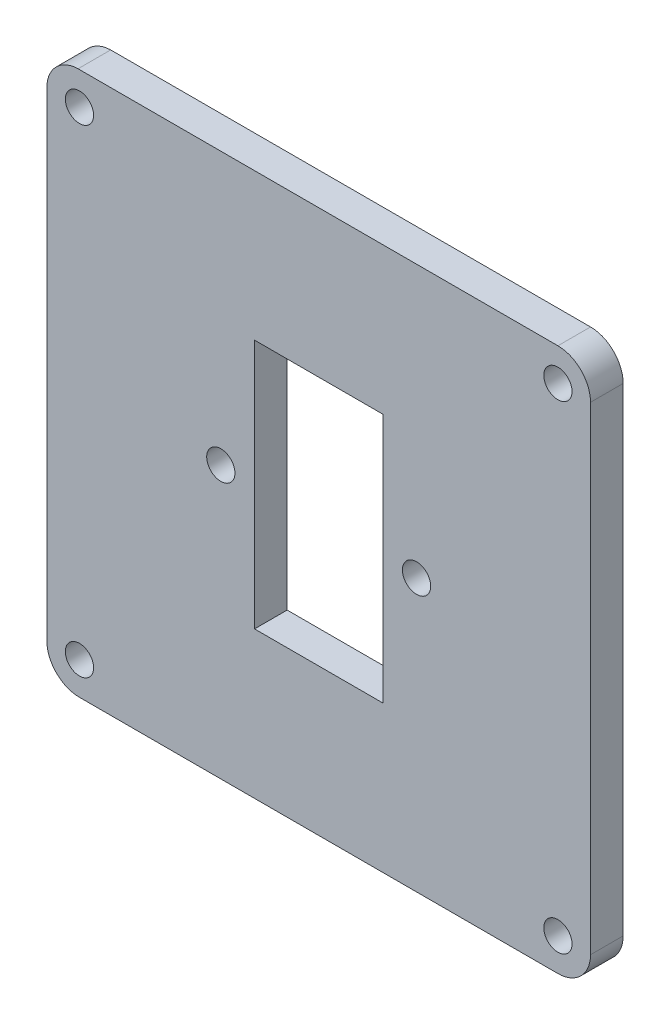
ISO-10303-21;
HEADER;
FILE_DESCRIPTION(('STEP AP214'),'2;1');
FILE_NAME('part.step','',(''),(''),'','','');
FILE_SCHEMA(('AUTOMOTIVE_DESIGN { 1 0 10303 214 1 1 1 1 }'));
ENDSEC;
DATA;
#1=APPLICATION_CONTEXT('core data for automotive mechanical design processes');
#2=APPLICATION_PROTOCOL_DEFINITION('international standard','automotive_design',2000,#1);
#3=PRODUCT_CONTEXT('',#1,'mechanical');
#4=PRODUCT('Part','Part','',(#3));
#5=PRODUCT_RELATED_PRODUCT_CATEGORY('part','',(#4));
#6=PRODUCT_DEFINITION_FORMATION('','',#4);
#7=PRODUCT_DEFINITION_CONTEXT('part definition',#1,'design');
#8=PRODUCT_DEFINITION('design','',#6,#7);
#9=PRODUCT_DEFINITION_SHAPE('','',#8);
#10=(LENGTH_UNIT() NAMED_UNIT(*) SI_UNIT(.MILLI.,.METRE.));
#11=(NAMED_UNIT(*) PLANE_ANGLE_UNIT() SI_UNIT($,.RADIAN.));
#12=(NAMED_UNIT(*) SI_UNIT($,.STERADIAN.) SOLID_ANGLE_UNIT());
#13=UNCERTAINTY_MEASURE_WITH_UNIT(LENGTH_MEASURE(1.E-05),#10,'distance_accuracy_value','');
#14=(GEOMETRIC_REPRESENTATION_CONTEXT(3) GLOBAL_UNCERTAINTY_ASSIGNED_CONTEXT((#13)) GLOBAL_UNIT_ASSIGNED_CONTEXT((#10,
#11,#12)) REPRESENTATION_CONTEXT('',''));
#15=CARTESIAN_POINT('',(0.,0.,0.));
#16=DIRECTION('',(0.,0.,1.));
#17=DIRECTION('',(1.,0.,0.));
#18=AXIS2_PLACEMENT_3D('',#15,#16,#17);
#19=CARTESIAN_POINT('',(36.3223987519712,20.1294987578669,3.));
#20=DIRECTION('',(0.,0.,1.));
#21=DIRECTION('',(1.,0.,0.));
#22=AXIS2_PLACEMENT_3D('',#19,#20,#21);
#23=PLANE('',#22);
#24=CARTESIAN_POINT('',(36.3225499958682,20.1296499967222,3.));
#25=DIRECTION('',(0.,0.,1.));
#26=DIRECTION('',(1.,0.,0.));
#27=AXIS2_PLACEMENT_3D('',#24,#25,#26);
#28=CIRCLE('',#27,1.29995000480762);
#29=CARTESIAN_POINT('',(37.6225000006758,20.1296499967222,3.));
#30=VERTEX_POINT('',#29);
#31=EDGE_CURVE('E164',#30,#30,#28,.T.);
#32=ORIENTED_EDGE('',*,*,#31,.F.);
#33=EDGE_LOOP('',(#32));
#34=FACE_BOUND('',#33,.T.);
#35=CARTESIAN_POINT('',(67.3225499958679,42.1296499967222,3.));
#36=DIRECTION('',(0.,0.,1.));
#37=DIRECTION('',(1.,0.,0.));
#38=AXIS2_PLACEMENT_3D('',#35,#36,#37);
#39=CIRCLE('',#38,1.29995000480762);
#40=CARTESIAN_POINT('',(68.6225000006755,42.1296499967222,3.));
#41=VERTEX_POINT('',#40);
#42=EDGE_CURVE('E176',#41,#41,#39,.T.);
#43=ORIENTED_EDGE('',*,*,#42,.F.);
#44=EDGE_LOOP('',(#43));
#45=FACE_BOUND('',#44,.T.);
#46=CARTESIAN_POINT('',(36.322500001637,64.1296999986452,3.));
#47=DIRECTION('',(0.,0.,1.));
#48=DIRECTION('',(1.,0.,0.));
#49=AXIS2_PLACEMENT_3D('',#46,#47,#48);
#50=CIRCLE('',#49,1.30000000192313);
#51=CARTESIAN_POINT('',(37.6225000035601,64.1296999986452,3.));
#52=VERTEX_POINT('',#51);
#53=EDGE_CURVE('E188',#52,#52,#50,.T.);
#54=ORIENTED_EDGE('',*,*,#53,.F.);
#55=EDGE_LOOP('',(#54));
#56=FACE_BOUND('',#55,.T.);
#57=CARTESIAN_POINT('',(36.3223987519712,20.1294987578669,3.));
#58=DIRECTION('',(0.,0.,1.));
#59=DIRECTION('',(1.,0.,0.));
#60=AXIS2_PLACEMENT_3D('',#57,#58,#59);
#61=CIRCLE('',#60,2.99989875900708);
#62=CARTESIAN_POINT('',(33.3224999997141,20.1297000005628,3.));
#63=VERTEX_POINT('',#62);
#64=CARTESIAN_POINT('',(36.3224999997142,17.1296000005684,3.));
#65=VERTEX_POINT('',#64);
#66=EDGE_CURVE('E194',#63,#65,#61,.T.);
#67=ORIENTED_EDGE('',*,*,#66,.T.);
#68=DIRECTION('',(1.,0.,0.));
#69=VECTOR('',#68,1.);
#70=CARTESIAN_POINT('',(80.3224999997142,17.1296000005683,3.));
#71=LINE('',#70,#69);
#72=CARTESIAN_POINT('',(80.3224999997142,17.1296000005683,3.));
#73=VERTEX_POINT('',#72);
#74=EDGE_CURVE('E197',#65,#73,#71,.T.);
#75=ORIENTED_EDGE('',*,*,#74,.T.);
#76=CARTESIAN_POINT('',(80.3224305409756,20.1296694586582,3.));
#77=DIRECTION('',(0.,0.,1.));
#78=DIRECTION('',(1.,0.,0.));
#79=AXIS2_PLACEMENT_3D('',#76,#77,#78);
#80=CIRCLE('',#79,3.00006945889396);
#81=CARTESIAN_POINT('',(83.3224999997141,20.1297000005485,3.));
#82=VERTEX_POINT('',#81);
#83=EDGE_CURVE('E200',#73,#82,#80,.T.);
#84=ORIENTED_EDGE('',*,*,#83,.T.);
#85=DIRECTION('',(0.,1.,0.));
#86=VECTOR('',#85,1.);
#87=CARTESIAN_POINT('',(83.3224999997141,64.1296000005696,3.));
#88=LINE('',#87,#86);
#89=CARTESIAN_POINT('',(83.3224999997141,64.1296000005696,3.));
#90=VERTEX_POINT('',#89);
#91=EDGE_CURVE('E202',#82,#90,#88,.T.);
#92=ORIENTED_EDGE('',*,*,#91,.T.);
#93=CARTESIAN_POINT('',(80.3225585752163,64.1296585760706,3.));
#94=DIRECTION('',(0.,0.,1.));
#95=DIRECTION('',(1.,0.,0.));
#96=AXIS2_PLACEMENT_3D('',#93,#94,#95);
#97=CIRCLE('',#96,2.99994142506962);
#98=CARTESIAN_POINT('',(80.322499999714,67.1296000005684,3.));
#99=VERTEX_POINT('',#98);
#100=EDGE_CURVE('E204',#90,#99,#97,.T.);
#101=ORIENTED_EDGE('',*,*,#100,.T.);
#102=DIRECTION('',(-0.999999997928593,-6.43646969992468E-05,0.));
#103=VECTOR('',#102,1.);
#104=CARTESIAN_POINT('',(36.1917165795784,67.1267595360593,3.));
#105=LINE('',#104,#103);
#106=CARTESIAN_POINT('',(36.1917165795784,67.1267595360593,3.));
#107=VERTEX_POINT('',#106);
#108=EDGE_CURVE('E206',#99,#107,#105,.T.);
#109=ORIENTED_EDGE('',*,*,#108,.T.);
#110=CARTESIAN_POINT('',(36.2554163805233,64.193831557889,3.));
#111=DIRECTION('',(0.,0.,1.));
#112=DIRECTION('',(1.,0.,0.));
#113=AXIS2_PLACEMENT_3D('',#110,#111,#112);
#114=CIRCLE('',#113,2.93361963958769);
#115=CARTESIAN_POINT('',(33.3224999997141,64.1296000005699,3.));
#116=VERTEX_POINT('',#115);
#117=EDGE_CURVE('E208',#107,#116,#114,.T.);
#118=ORIENTED_EDGE('',*,*,#117,.T.);
#119=DIRECTION('',(0.,-1.,0.));
#120=VECTOR('',#119,1.);
#121=CARTESIAN_POINT('',(33.3224999997141,20.1297000005628,3.));
#122=LINE('',#121,#120);
#123=EDGE_CURVE('E210',#116,#63,#122,.T.);
#124=ORIENTED_EDGE('',*,*,#123,.T.);
#125=EDGE_LOOP('',(#67,#75,#84,#92,#101,#109,#118,#124));
#126=FACE_BOUND('',#125,.T.);
#127=CARTESIAN_POINT('',(80.3225000016379,64.1296999986453,3.));
#128=DIRECTION('',(0.,0.,1.));
#129=DIRECTION('',(1.,0.,0.));
#130=AXIS2_PLACEMENT_3D('',#127,#128,#129);
#131=CIRCLE('',#130,1.30000000192322);
#132=CARTESIAN_POINT('',(81.6225000035611,64.1296999986453,3.));
#133=VERTEX_POINT('',#132);
#134=EDGE_CURVE('E182',#133,#133,#131,.T.);
#135=ORIENTED_EDGE('',*,*,#134,.F.);
#136=EDGE_LOOP('',(#135));
#137=FACE_BOUND('',#136,.T.);
#138=CARTESIAN_POINT('',(49.3224499997141,42.1296500005684,3.));
#139=DIRECTION('',(0.,0.,1.));
#140=DIRECTION('',(1.,0.,0.));
#141=AXIS2_PLACEMENT_3D('',#138,#139,#140);
#142=CIRCLE('',#141,1.2999500009616);
#143=CARTESIAN_POINT('',(50.6224000006757,42.1296500005684,3.));
#144=VERTEX_POINT('',#143);
#145=EDGE_CURVE('E170',#144,#144,#142,.T.);
#146=ORIENTED_EDGE('',*,*,#145,.F.);
#147=EDGE_LOOP('',(#146));
#148=FACE_BOUND('',#147,.T.);
#149=CARTESIAN_POINT('',(80.3225499958684,20.1296499967222,3.));
#150=DIRECTION('',(0.,0.,1.));
#151=DIRECTION('',(1.,0.,0.));
#152=AXIS2_PLACEMENT_3D('',#149,#150,#151);
#153=CIRCLE('',#152,1.29995000480758);
#154=CARTESIAN_POINT('',(81.622500000676,20.1296499967222,3.));
#155=VERTEX_POINT('',#154);
#156=EDGE_CURVE('E158',#155,#155,#153,.T.);
#157=ORIENTED_EDGE('',*,*,#156,.F.);
#158=EDGE_LOOP('',(#157));
#159=FACE_BOUND('',#158,.T.);
#160=DIRECTION('',(1.,0.,0.));
#161=VECTOR('',#160,1.);
#162=CARTESIAN_POINT('',(52.4224999997141,30.6296000005684,3.));
#163=LINE('',#162,#161);
#164=CARTESIAN_POINT('',(52.4224999997141,30.6296000005684,3.));
#165=VERTEX_POINT('',#164);
#166=CARTESIAN_POINT('',(64.2224999997142,30.6296000005684,3.));
#167=VERTEX_POINT('',#166);
#168=EDGE_CURVE('E130',#165,#167,#163,.T.);
#169=ORIENTED_EDGE('',*,*,#168,.F.);
#170=DIRECTION('',(0.,-1.,0.));
#171=VECTOR('',#170,1.);
#172=CARTESIAN_POINT('',(52.4224999997141,30.6296000005684,3.));
#173=LINE('',#172,#171);
#174=CARTESIAN_POINT('',(52.422499999714,53.6296000005683,3.));
#175=VERTEX_POINT('',#174);
#176=EDGE_CURVE('E122',#175,#165,#173,.T.);
#177=ORIENTED_EDGE('',*,*,#176,.F.);
#178=DIRECTION('',(-1.,0.,0.));
#179=VECTOR('',#178,1.);
#180=CARTESIAN_POINT('',(52.422499999714,53.6296000005683,3.));
#181=LINE('',#180,#179);
#182=CARTESIAN_POINT('',(64.222499999714,53.6296000005683,3.));
#183=VERTEX_POINT('',#182);
#184=EDGE_CURVE('E144',#183,#175,#181,.T.);
#185=ORIENTED_EDGE('',*,*,#184,.F.);
#186=DIRECTION('',(0.,1.,0.));
#187=VECTOR('',#186,1.);
#188=CARTESIAN_POINT('',(64.222499999714,53.6296000005683,3.));
#189=LINE('',#188,#187);
#190=EDGE_CURVE('E142',#167,#183,#189,.T.);
#191=ORIENTED_EDGE('',*,*,#190,.F.);
#192=EDGE_LOOP('',(#169,#177,#185,#191));
#193=FACE_BOUND('',#192,.T.);
#194=ADVANCED_FACE('F33',(#34,#45,#56,#126,#137,#148,#159,#193),#23,.T.);
#195=CARTESIAN_POINT('',(36.3223987519712,20.1294987578669,0.));
#196=DIRECTION('',(0.,0.,1.));
#197=DIRECTION('',(1.,0.,0.));
#198=AXIS2_PLACEMENT_3D('',#195,#196,#197);
#199=PLANE('',#198);
#200=CARTESIAN_POINT('',(80.3225499958684,20.1296499967222,0.));
#201=DIRECTION('',(0.,0.,1.));
#202=DIRECTION('',(1.,0.,0.));
#203=AXIS2_PLACEMENT_3D('',#200,#201,#202);
#204=CIRCLE('',#203,1.29995000480758);
#205=CARTESIAN_POINT('',(81.622500000676,20.1296499967222,0.));
#206=VERTEX_POINT('',#205);
#207=EDGE_CURVE('E138',#206,#206,#204,.T.);
#208=ORIENTED_EDGE('',*,*,#207,.T.);
#209=EDGE_LOOP('',(#208));
#210=FACE_BOUND('',#209,.T.);
#211=CARTESIAN_POINT('',(36.3225499958682,20.1296499967222,0.));
#212=DIRECTION('',(0.,0.,1.));
#213=DIRECTION('',(1.,0.,0.));
#214=AXIS2_PLACEMENT_3D('',#211,#212,#213);
#215=CIRCLE('',#214,1.29995000480762);
#216=CARTESIAN_POINT('',(37.6225000006758,20.1296499967222,0.));
#217=VERTEX_POINT('',#216);
#218=EDGE_CURVE('E161',#217,#217,#215,.T.);
#219=ORIENTED_EDGE('',*,*,#218,.T.);
#220=EDGE_LOOP('',(#219));
#221=FACE_BOUND('',#220,.T.);
#222=CARTESIAN_POINT('',(49.3224499997141,42.1296500005684,0.));
#223=DIRECTION('',(0.,0.,1.));
#224=DIRECTION('',(1.,0.,0.));
#225=AXIS2_PLACEMENT_3D('',#222,#223,#224);
#226=CIRCLE('',#225,1.2999500009616);
#227=CARTESIAN_POINT('',(50.6224000006757,42.1296500005684,0.));
#228=VERTEX_POINT('',#227);
#229=EDGE_CURVE('E167',#228,#228,#226,.T.);
#230=ORIENTED_EDGE('',*,*,#229,.T.);
#231=EDGE_LOOP('',(#230));
#232=FACE_BOUND('',#231,.T.);
#233=CARTESIAN_POINT('',(67.3225499958679,42.1296499967222,0.));
#234=DIRECTION('',(0.,0.,1.));
#235=DIRECTION('',(1.,0.,0.));
#236=AXIS2_PLACEMENT_3D('',#233,#234,#235);
#237=CIRCLE('',#236,1.29995000480762);
#238=CARTESIAN_POINT('',(68.6225000006755,42.1296499967222,0.));
#239=VERTEX_POINT('',#238);
#240=EDGE_CURVE('E173',#239,#239,#237,.T.);
#241=ORIENTED_EDGE('',*,*,#240,.T.);
#242=EDGE_LOOP('',(#241));
#243=FACE_BOUND('',#242,.T.);
#244=CARTESIAN_POINT('',(80.3225000016379,64.1296999986453,0.));
#245=DIRECTION('',(0.,0.,1.));
#246=DIRECTION('',(1.,0.,0.));
#247=AXIS2_PLACEMENT_3D('',#244,#245,#246);
#248=CIRCLE('',#247,1.30000000192322);
#249=CARTESIAN_POINT('',(81.6225000035611,64.1296999986453,0.));
#250=VERTEX_POINT('',#249);
#251=EDGE_CURVE('E179',#250,#250,#248,.T.);
#252=ORIENTED_EDGE('',*,*,#251,.T.);
#253=EDGE_LOOP('',(#252));
#254=FACE_BOUND('',#253,.T.);
#255=CARTESIAN_POINT('',(36.322500001637,64.1296999986452,0.));
#256=DIRECTION('',(0.,0.,1.));
#257=DIRECTION('',(1.,0.,0.));
#258=AXIS2_PLACEMENT_3D('',#255,#256,#257);
#259=CIRCLE('',#258,1.30000000192313);
#260=CARTESIAN_POINT('',(37.6225000035601,64.1296999986452,0.));
#261=VERTEX_POINT('',#260);
#262=EDGE_CURVE('E185',#261,#261,#259,.T.);
#263=ORIENTED_EDGE('',*,*,#262,.T.);
#264=EDGE_LOOP('',(#263));
#265=FACE_BOUND('',#264,.T.);
#266=CARTESIAN_POINT('',(36.3223987519712,20.1294987578669,0.));
#267=DIRECTION('',(0.,0.,1.));
#268=DIRECTION('',(1.,0.,0.));
#269=AXIS2_PLACEMENT_3D('',#266,#267,#268);
#270=CIRCLE('',#269,2.99989875900708);
#271=CARTESIAN_POINT('',(33.3224999997141,20.1297000005628,0.));
#272=VERTEX_POINT('',#271);
#273=CARTESIAN_POINT('',(36.3224999997142,17.1296000005684,0.));
#274=VERTEX_POINT('',#273);
#275=EDGE_CURVE('E191',#272,#274,#270,.T.);
#276=ORIENTED_EDGE('',*,*,#275,.F.);
#277=DIRECTION('',(0.,-1.,0.));
#278=VECTOR('',#277,1.);
#279=CARTESIAN_POINT('',(33.3224999997141,20.1297000005628,0.));
#280=LINE('',#279,#278);
#281=CARTESIAN_POINT('',(33.3224999997141,64.1296000005699,0.));
#282=VERTEX_POINT('',#281);
#283=EDGE_CURVE('E198',#282,#272,#280,.T.);
#284=ORIENTED_EDGE('',*,*,#283,.F.);
#285=CARTESIAN_POINT('',(36.2554163805233,64.193831557889,0.));
#286=DIRECTION('',(0.,0.,1.));
#287=DIRECTION('',(1.,0.,0.));
#288=AXIS2_PLACEMENT_3D('',#285,#286,#287);
#289=CIRCLE('',#288,2.93361963958769);
#290=CARTESIAN_POINT('',(36.1917165795784,67.1267595360593,0.));
#291=VERTEX_POINT('',#290);
#292=EDGE_CURVE('E225',#291,#282,#289,.T.);
#293=ORIENTED_EDGE('',*,*,#292,.F.);
#294=DIRECTION('',(-0.999999997928593,-6.43646969992468E-05,0.));
#295=VECTOR('',#294,1.);
#296=CARTESIAN_POINT('',(36.1917165795784,67.1267595360593,0.));
#297=LINE('',#296,#295);
#298=CARTESIAN_POINT('',(80.322499999714,67.1296000005684,0.));
#299=VERTEX_POINT('',#298);
#300=EDGE_CURVE('E223',#299,#291,#297,.T.);
#301=ORIENTED_EDGE('',*,*,#300,.F.);
#302=CARTESIAN_POINT('',(80.3225585752163,64.1296585760706,0.));
#303=DIRECTION('',(0.,0.,1.));
#304=DIRECTION('',(1.,0.,0.));
#305=AXIS2_PLACEMENT_3D('',#302,#303,#304);
#306=CIRCLE('',#305,2.99994142506962);
#307=CARTESIAN_POINT('',(83.3224999997141,64.1296000005696,0.));
#308=VERTEX_POINT('',#307);
#309=EDGE_CURVE('E221',#308,#299,#306,.T.);
#310=ORIENTED_EDGE('',*,*,#309,.F.);
#311=DIRECTION('',(0.,1.,0.));
#312=VECTOR('',#311,1.);
#313=CARTESIAN_POINT('',(83.3224999997141,64.1296000005696,0.));
#314=LINE('',#313,#312);
#315=CARTESIAN_POINT('',(83.3224999997141,20.1297000005485,0.));
#316=VERTEX_POINT('',#315);
#317=EDGE_CURVE('E219',#316,#308,#314,.T.);
#318=ORIENTED_EDGE('',*,*,#317,.F.);
#319=CARTESIAN_POINT('',(80.3224305409756,20.1296694586582,0.));
#320=DIRECTION('',(0.,0.,1.));
#321=DIRECTION('',(1.,0.,0.));
#322=AXIS2_PLACEMENT_3D('',#319,#320,#321);
#323=CIRCLE('',#322,3.00006945889396);
#324=CARTESIAN_POINT('',(80.3224999997142,17.1296000005683,0.));
#325=VERTEX_POINT('',#324);
#326=EDGE_CURVE('E217',#325,#316,#323,.T.);
#327=ORIENTED_EDGE('',*,*,#326,.F.);
#328=DIRECTION('',(1.,0.,0.));
#329=VECTOR('',#328,1.);
#330=CARTESIAN_POINT('',(80.3224999997142,17.1296000005683,0.));
#331=LINE('',#330,#329);
#332=EDGE_CURVE('E215',#274,#325,#331,.T.);
#333=ORIENTED_EDGE('',*,*,#332,.F.);
#334=EDGE_LOOP('',(#276,#284,#293,#301,#310,#318,#327,#333));
#335=FACE_BOUND('',#334,.T.);
#336=DIRECTION('',(0.,-1.,0.));
#337=VECTOR('',#336,1.);
#338=CARTESIAN_POINT('',(52.4224999997141,30.6296000005684,0.));
#339=LINE('',#338,#337);
#340=CARTESIAN_POINT('',(52.422499999714,53.6296000005683,0.));
#341=VERTEX_POINT('',#340);
#342=CARTESIAN_POINT('',(52.4224999997141,30.6296000005684,0.));
#343=VERTEX_POINT('',#342);
#344=EDGE_CURVE('E56',#341,#343,#339,.T.);
#345=ORIENTED_EDGE('',*,*,#344,.T.);
#346=DIRECTION('',(1.,0.,0.));
#347=VECTOR('',#346,1.);
#348=CARTESIAN_POINT('',(52.4224999997141,30.6296000005684,0.));
#349=LINE('',#348,#347);
#350=CARTESIAN_POINT('',(64.2224999997142,30.6296000005684,0.));
#351=VERTEX_POINT('',#350);
#352=EDGE_CURVE('E137',#343,#351,#349,.T.);
#353=ORIENTED_EDGE('',*,*,#352,.T.);
#354=DIRECTION('',(0.,1.,0.));
#355=VECTOR('',#354,1.);
#356=CARTESIAN_POINT('',(64.222499999714,53.6296000005683,0.));
#357=LINE('',#356,#355);
#358=CARTESIAN_POINT('',(64.222499999714,53.6296000005683,0.));
#359=VERTEX_POINT('',#358);
#360=EDGE_CURVE('E150',#351,#359,#357,.T.);
#361=ORIENTED_EDGE('',*,*,#360,.T.);
#362=DIRECTION('',(-1.,0.,0.));
#363=VECTOR('',#362,1.);
#364=CARTESIAN_POINT('',(52.422499999714,53.6296000005683,0.));
#365=LINE('',#364,#363);
#366=EDGE_CURVE('E131',#359,#341,#365,.T.);
#367=ORIENTED_EDGE('',*,*,#366,.T.);
#368=EDGE_LOOP('',(#345,#353,#361,#367));
#369=FACE_BOUND('',#368,.T.);
#370=ADVANCED_FACE('F255',(#210,#221,#232,#243,#254,#265,#335,#369),#199,.F.);
#371=CARTESIAN_POINT('',(36.3223987519712,20.1294987578669,3.));
#372=DIRECTION('',(0.,0.,-1.));
#373=DIRECTION('',(-1.,0.,0.));
#374=AXIS2_PLACEMENT_3D('',#371,#372,#373);
#375=CYLINDRICAL_SURFACE('',#374,2.99989875900708);
#376=ORIENTED_EDGE('',*,*,#275,.T.);
#377=DIRECTION('',(0.,0.,-1.));
#378=VECTOR('',#377,1.);
#379=CARTESIAN_POINT('',(36.3224999997142,17.1296000005684,3.));
#380=LINE('',#379,#378);
#381=EDGE_CURVE('E11',#65,#274,#380,.T.);
#382=ORIENTED_EDGE('',*,*,#381,.F.);
#383=ORIENTED_EDGE('',*,*,#66,.F.);
#384=DIRECTION('',(0.,0.,-1.));
#385=VECTOR('',#384,1.);
#386=CARTESIAN_POINT('',(33.3224999997141,20.1297000005628,3.));
#387=LINE('',#386,#385);
#388=EDGE_CURVE('E212',#63,#272,#387,.T.);
#389=ORIENTED_EDGE('',*,*,#388,.T.);
#390=EDGE_LOOP('',(#376,#382,#383,#389));
#391=FACE_BOUND('',#390,.T.);
#392=ADVANCED_FACE('F35',(#391),#375,.T.);
#393=CARTESIAN_POINT('',(80.3224999997142,17.1296000005683,3.));
#394=DIRECTION('',(0.,1.,0.));
#395=DIRECTION('',(-1.,0.,0.));
#396=AXIS2_PLACEMENT_3D('',#393,#394,#395);
#397=PLANE('',#396);
#398=ORIENTED_EDGE('',*,*,#332,.T.);
#399=DIRECTION('',(0.,0.,-1.));
#400=VECTOR('',#399,1.);
#401=CARTESIAN_POINT('',(80.3224999997142,17.1296000005683,3.));
#402=LINE('',#401,#400);
#403=EDGE_CURVE('E41',#73,#325,#402,.T.);
#404=ORIENTED_EDGE('',*,*,#403,.F.);
#405=ORIENTED_EDGE('',*,*,#74,.F.);
#406=ORIENTED_EDGE('',*,*,#381,.T.);
#407=EDGE_LOOP('',(#398,#404,#405,#406));
#408=FACE_BOUND('',#407,.T.);
#409=ADVANCED_FACE('F273',(#408),#397,.F.);
#410=CARTESIAN_POINT('',(80.3224305409756,20.1296694586582,3.));
#411=DIRECTION('',(0.,0.,-1.));
#412=DIRECTION('',(-1.,0.,0.));
#413=AXIS2_PLACEMENT_3D('',#410,#411,#412);
#414=CYLINDRICAL_SURFACE('',#413,3.00006945889396);
#415=ORIENTED_EDGE('',*,*,#326,.T.);
#416=DIRECTION('',(0.,0.,-1.));
#417=VECTOR('',#416,1.);
#418=CARTESIAN_POINT('',(83.3224999997141,20.1297000005485,3.));
#419=LINE('',#418,#417);
#420=EDGE_CURVE('E242',#82,#316,#419,.T.);
#421=ORIENTED_EDGE('',*,*,#420,.F.);
#422=ORIENTED_EDGE('',*,*,#83,.F.);
#423=ORIENTED_EDGE('',*,*,#403,.T.);
#424=EDGE_LOOP('',(#415,#421,#422,#423));
#425=FACE_BOUND('',#424,.T.);
#426=ADVANCED_FACE('F249',(#425),#414,.T.);
#427=CARTESIAN_POINT('',(83.3224999997141,64.1296000005696,3.));
#428=DIRECTION('',(-1.,0.,0.));
#429=DIRECTION('',(0.,0.,1.));
#430=AXIS2_PLACEMENT_3D('',#427,#428,#429);
#431=PLANE('',#430);
#432=ORIENTED_EDGE('',*,*,#317,.T.);
#433=DIRECTION('',(0.,0.,-1.));
#434=VECTOR('',#433,1.);
#435=CARTESIAN_POINT('',(83.3224999997141,64.1296000005696,3.));
#436=LINE('',#435,#434);
#437=EDGE_CURVE('E239',#90,#308,#436,.T.);
#438=ORIENTED_EDGE('',*,*,#437,.F.);
#439=ORIENTED_EDGE('',*,*,#91,.F.);
#440=ORIENTED_EDGE('',*,*,#420,.T.);
#441=EDGE_LOOP('',(#432,#438,#439,#440));
#442=FACE_BOUND('',#441,.T.);
#443=ADVANCED_FACE('F261',(#442),#431,.F.);
#444=CARTESIAN_POINT('',(80.3225585752163,64.1296585760706,3.));
#445=DIRECTION('',(0.,0.,-1.));
#446=DIRECTION('',(-1.,0.,0.));
#447=AXIS2_PLACEMENT_3D('',#444,#445,#446);
#448=CYLINDRICAL_SURFACE('',#447,2.99994142506962);
#449=ORIENTED_EDGE('',*,*,#309,.T.);
#450=DIRECTION('',(0.,0.,-1.));
#451=VECTOR('',#450,1.);
#452=CARTESIAN_POINT('',(80.322499999714,67.1296000005684,3.));
#453=LINE('',#452,#451);
#454=EDGE_CURVE('E236',#99,#299,#453,.T.);
#455=ORIENTED_EDGE('',*,*,#454,.F.);
#456=ORIENTED_EDGE('',*,*,#100,.F.);
#457=ORIENTED_EDGE('',*,*,#437,.T.);
#458=EDGE_LOOP('',(#449,#455,#456,#457));
#459=FACE_BOUND('',#458,.T.);
#460=ADVANCED_FACE('F265',(#459),#448,.T.);
#461=CARTESIAN_POINT('',(36.1917165795784,67.1267595360593,3.));
#462=DIRECTION('',(6.43646969992468E-05,-0.999999997928593,0.));
#463=DIRECTION('',(0.999999997928593,6.43646969992468E-05,0.));
#464=AXIS2_PLACEMENT_3D('',#461,#462,#463);
#465=PLANE('',#464);
#466=ORIENTED_EDGE('',*,*,#300,.T.);
#467=DIRECTION('',(0.,0.,-1.));
#468=VECTOR('',#467,1.);
#469=CARTESIAN_POINT('',(36.1917165795784,67.1267595360593,3.));
#470=LINE('',#469,#468);
#471=EDGE_CURVE('E233',#107,#291,#470,.T.);
#472=ORIENTED_EDGE('',*,*,#471,.F.);
#473=ORIENTED_EDGE('',*,*,#108,.F.);
#474=ORIENTED_EDGE('',*,*,#454,.T.);
#475=EDGE_LOOP('',(#466,#472,#473,#474));
#476=FACE_BOUND('',#475,.T.);
#477=ADVANCED_FACE('F286',(#476),#465,.F.);
#478=CARTESIAN_POINT('',(36.2554163805233,64.193831557889,3.));
#479=DIRECTION('',(0.,0.,-1.));
#480=DIRECTION('',(-1.,0.,0.));
#481=AXIS2_PLACEMENT_3D('',#478,#479,#480);
#482=CYLINDRICAL_SURFACE('',#481,2.93361963958769);
#483=ORIENTED_EDGE('',*,*,#292,.T.);
#484=DIRECTION('',(0.,0.,-1.));
#485=VECTOR('',#484,1.);
#486=CARTESIAN_POINT('',(33.3224999997141,64.1296000005699,3.));
#487=LINE('',#486,#485);
#488=EDGE_CURVE('E230',#116,#282,#487,.T.);
#489=ORIENTED_EDGE('',*,*,#488,.F.);
#490=ORIENTED_EDGE('',*,*,#117,.F.);
#491=ORIENTED_EDGE('',*,*,#471,.T.);
#492=EDGE_LOOP('',(#483,#489,#490,#491));
#493=FACE_BOUND('',#492,.T.);
#494=ADVANCED_FACE('F284',(#493),#482,.T.);
#495=CARTESIAN_POINT('',(33.3224999997141,20.1297000005628,3.));
#496=DIRECTION('',(1.,0.,0.));
#497=DIRECTION('',(0.,0.,-1.));
#498=AXIS2_PLACEMENT_3D('',#495,#496,#497);
#499=PLANE('',#498);
#500=ORIENTED_EDGE('',*,*,#283,.T.);
#501=ORIENTED_EDGE('',*,*,#388,.F.);
#502=ORIENTED_EDGE('',*,*,#123,.F.);
#503=ORIENTED_EDGE('',*,*,#488,.T.);
#504=EDGE_LOOP('',(#500,#501,#502,#503));
#505=FACE_BOUND('',#504,.T.);
#506=ADVANCED_FACE('F279',(#505),#499,.F.);
#507=CARTESIAN_POINT('',(36.322500001637,64.1296999986452,3.));
#508=DIRECTION('',(0.,0.,-1.));
#509=DIRECTION('',(-1.,0.,0.));
#510=AXIS2_PLACEMENT_3D('',#507,#508,#509);
#511=CYLINDRICAL_SURFACE('',#510,1.30000000192313);
#512=ORIENTED_EDGE('',*,*,#53,.T.);
#513=EDGE_LOOP('',(#512));
#514=FACE_BOUND('',#513,.T.);
#515=ORIENTED_EDGE('',*,*,#262,.F.);
#516=EDGE_LOOP('',(#515));
#517=FACE_BOUND('',#516,.T.);
#518=ADVANCED_FACE('F306',(#514,#517),#511,.F.);
#519=CARTESIAN_POINT('',(80.3225000016379,64.1296999986453,3.));
#520=DIRECTION('',(0.,0.,-1.));
#521=DIRECTION('',(-1.,0.,0.));
#522=AXIS2_PLACEMENT_3D('',#519,#520,#521);
#523=CYLINDRICAL_SURFACE('',#522,1.30000000192322);
#524=ORIENTED_EDGE('',*,*,#134,.T.);
#525=EDGE_LOOP('',(#524));
#526=FACE_BOUND('',#525,.T.);
#527=ORIENTED_EDGE('',*,*,#251,.F.);
#528=EDGE_LOOP('',(#527));
#529=FACE_BOUND('',#528,.T.);
#530=ADVANCED_FACE('F313',(#526,#529),#523,.F.);
#531=CARTESIAN_POINT('',(67.3225499958679,42.1296499967222,3.));
#532=DIRECTION('',(0.,0.,-1.));
#533=DIRECTION('',(-1.,0.,0.));
#534=AXIS2_PLACEMENT_3D('',#531,#532,#533);
#535=CYLINDRICAL_SURFACE('',#534,1.29995000480762);
#536=ORIENTED_EDGE('',*,*,#42,.T.);
#537=EDGE_LOOP('',(#536));
#538=FACE_BOUND('',#537,.T.);
#539=ORIENTED_EDGE('',*,*,#240,.F.);
#540=EDGE_LOOP('',(#539));
#541=FACE_BOUND('',#540,.T.);
#542=ADVANCED_FACE('F318',(#538,#541),#535,.F.);
#543=CARTESIAN_POINT('',(49.3224499997141,42.1296500005684,3.));
#544=DIRECTION('',(0.,0.,-1.));
#545=DIRECTION('',(-1.,0.,0.));
#546=AXIS2_PLACEMENT_3D('',#543,#544,#545);
#547=CYLINDRICAL_SURFACE('',#546,1.2999500009616);
#548=ORIENTED_EDGE('',*,*,#145,.T.);
#549=EDGE_LOOP('',(#548));
#550=FACE_BOUND('',#549,.T.);
#551=ORIENTED_EDGE('',*,*,#229,.F.);
#552=EDGE_LOOP('',(#551));
#553=FACE_BOUND('',#552,.T.);
#554=ADVANCED_FACE('F328',(#550,#553),#547,.F.);
#555=CARTESIAN_POINT('',(36.3225499958682,20.1296499967222,3.));
#556=DIRECTION('',(0.,0.,-1.));
#557=DIRECTION('',(-1.,0.,0.));
#558=AXIS2_PLACEMENT_3D('',#555,#556,#557);
#559=CYLINDRICAL_SURFACE('',#558,1.29995000480762);
#560=ORIENTED_EDGE('',*,*,#31,.T.);
#561=EDGE_LOOP('',(#560));
#562=FACE_BOUND('',#561,.T.);
#563=ORIENTED_EDGE('',*,*,#218,.F.);
#564=EDGE_LOOP('',(#563));
#565=FACE_BOUND('',#564,.T.);
#566=ADVANCED_FACE('F335',(#562,#565),#559,.F.);
#567=CARTESIAN_POINT('',(80.3225499958684,20.1296499967222,3.));
#568=DIRECTION('',(0.,0.,-1.));
#569=DIRECTION('',(-1.,0.,0.));
#570=AXIS2_PLACEMENT_3D('',#567,#568,#569);
#571=CYLINDRICAL_SURFACE('',#570,1.29995000480758);
#572=ORIENTED_EDGE('',*,*,#156,.T.);
#573=EDGE_LOOP('',(#572));
#574=FACE_BOUND('',#573,.T.);
#575=ORIENTED_EDGE('',*,*,#207,.F.);
#576=EDGE_LOOP('',(#575));
#577=FACE_BOUND('',#576,.T.);
#578=ADVANCED_FACE('F339',(#574,#577),#571,.F.);
#579=CARTESIAN_POINT('',(52.4224999997141,30.6296000005684,3.));
#580=DIRECTION('',(1.,0.,0.));
#581=DIRECTION('',(0.,1.,0.));
#582=AXIS2_PLACEMENT_3D('',#579,#580,#581);
#583=PLANE('',#582);
#584=ORIENTED_EDGE('',*,*,#344,.F.);
#585=DIRECTION('',(0.,0.,-1.));
#586=VECTOR('',#585,1.);
#587=CARTESIAN_POINT('',(52.422499999714,53.6296000005683,3.));
#588=LINE('',#587,#586);
#589=EDGE_CURVE('E126',#175,#341,#588,.T.);
#590=ORIENTED_EDGE('',*,*,#589,.F.);
#591=ORIENTED_EDGE('',*,*,#176,.T.);
#592=DIRECTION('',(0.,0.,-1.));
#593=VECTOR('',#592,1.);
#594=CARTESIAN_POINT('',(52.4224999997141,30.6296000005684,3.));
#595=LINE('',#594,#593);
#596=EDGE_CURVE('E125',#165,#343,#595,.T.);
#597=ORIENTED_EDGE('',*,*,#596,.T.);
#598=EDGE_LOOP('',(#584,#590,#591,#597));
#599=FACE_BOUND('',#598,.T.);
#600=ADVANCED_FACE('F124',(#599),#583,.T.);
#601=CARTESIAN_POINT('',(52.4224999997141,30.6296000005684,3.));
#602=DIRECTION('',(0.,1.,0.));
#603=DIRECTION('',(0.,0.,1.));
#604=AXIS2_PLACEMENT_3D('',#601,#602,#603);
#605=PLANE('',#604);
#606=ORIENTED_EDGE('',*,*,#352,.F.);
#607=ORIENTED_EDGE('',*,*,#596,.F.);
#608=ORIENTED_EDGE('',*,*,#168,.T.);
#609=DIRECTION('',(0.,0.,-1.));
#610=VECTOR('',#609,1.);
#611=CARTESIAN_POINT('',(64.2224999997142,30.6296000005684,3.));
#612=LINE('',#611,#610);
#613=EDGE_CURVE('E139',#167,#351,#612,.T.);
#614=ORIENTED_EDGE('',*,*,#613,.T.);
#615=EDGE_LOOP('',(#606,#607,#608,#614));
#616=FACE_BOUND('',#615,.T.);
#617=ADVANCED_FACE('F134',(#616),#605,.T.);
#618=CARTESIAN_POINT('',(64.222499999714,53.6296000005683,3.));
#619=DIRECTION('',(-1.,0.,0.));
#620=DIRECTION('',(0.,-1.,0.));
#621=AXIS2_PLACEMENT_3D('',#618,#619,#620);
#622=PLANE('',#621);
#623=ORIENTED_EDGE('',*,*,#360,.F.);
#624=ORIENTED_EDGE('',*,*,#613,.F.);
#625=ORIENTED_EDGE('',*,*,#190,.T.);
#626=DIRECTION('',(0.,0.,-1.));
#627=VECTOR('',#626,1.);
#628=CARTESIAN_POINT('',(64.222499999714,53.6296000005683,3.));
#629=LINE('',#628,#627);
#630=EDGE_CURVE('E48',#183,#359,#629,.T.);
#631=ORIENTED_EDGE('',*,*,#630,.T.);
#632=EDGE_LOOP('',(#623,#624,#625,#631));
#633=FACE_BOUND('',#632,.T.);
#634=ADVANCED_FACE('F348',(#633),#622,.T.);
#635=CARTESIAN_POINT('',(52.422499999714,53.6296000005683,3.));
#636=DIRECTION('',(0.,-1.,0.));
#637=DIRECTION('',(0.,0.,-1.));
#638=AXIS2_PLACEMENT_3D('',#635,#636,#637);
#639=PLANE('',#638);
#640=ORIENTED_EDGE('',*,*,#366,.F.);
#641=ORIENTED_EDGE('',*,*,#630,.F.);
#642=ORIENTED_EDGE('',*,*,#184,.T.);
#643=ORIENTED_EDGE('',*,*,#589,.T.);
#644=EDGE_LOOP('',(#640,#641,#642,#643));
#645=FACE_BOUND('',#644,.T.);
#646=ADVANCED_FACE('F351',(#645),#639,.T.);
#647=CLOSED_SHELL('',(#194,#370,#392,#409,#426,#443,#460,#477,#494,#506,#518,#530,#542,#554,
#566,#578,#600,#617,#634,#646));
#648=MANIFOLD_SOLID_BREP('B2',#647);
#649=ADVANCED_BREP_SHAPE_REPRESENTATION('',(#18,#648),#14);
#650=SHAPE_DEFINITION_REPRESENTATION(#9,#649);
ENDSEC;
END-ISO-10303-21;
